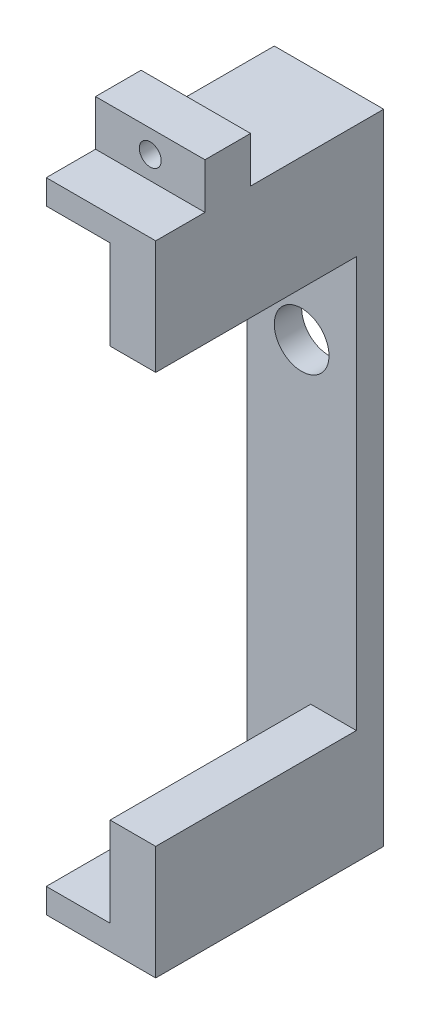
ISO-10303-21;
HEADER;
FILE_DESCRIPTION(('STEP AP214'),'2;1');
FILE_NAME('part.step','',(''),(''),'','','');
FILE_SCHEMA(('AUTOMOTIVE_DESIGN { 1 0 10303 214 1 1 1 1 }'));
ENDSEC;
DATA;
#1=APPLICATION_CONTEXT('core data for automotive mechanical design processes');
#2=APPLICATION_PROTOCOL_DEFINITION('international standard','automotive_design',2000,#1);
#3=PRODUCT_CONTEXT('',#1,'mechanical');
#4=PRODUCT('Part','Part','',(#3));
#5=PRODUCT_RELATED_PRODUCT_CATEGORY('part','',(#4));
#6=PRODUCT_DEFINITION_FORMATION('','',#4);
#7=PRODUCT_DEFINITION_CONTEXT('part definition',#1,'design');
#8=PRODUCT_DEFINITION('design','',#6,#7);
#9=PRODUCT_DEFINITION_SHAPE('','',#8);
#10=(LENGTH_UNIT() NAMED_UNIT(*) SI_UNIT(.MILLI.,.METRE.));
#11=(NAMED_UNIT(*) PLANE_ANGLE_UNIT() SI_UNIT($,.RADIAN.));
#12=(NAMED_UNIT(*) SI_UNIT($,.STERADIAN.) SOLID_ANGLE_UNIT());
#13=UNCERTAINTY_MEASURE_WITH_UNIT(LENGTH_MEASURE(1.E-05),#10,'distance_accuracy_value','');
#14=(GEOMETRIC_REPRESENTATION_CONTEXT(3) GLOBAL_UNCERTAINTY_ASSIGNED_CONTEXT((#13)) GLOBAL_UNIT_ASSIGNED_CONTEXT((#10,
#11,#12)) REPRESENTATION_CONTEXT('',''));
#15=CARTESIAN_POINT('',(0.,0.,0.));
#16=DIRECTION('',(0.,0.,1.));
#17=DIRECTION('',(1.,0.,0.));
#18=AXIS2_PLACEMENT_3D('',#15,#16,#17);
#19=CARTESIAN_POINT('',(-3.,17.5,12.5));
#20=DIRECTION('',(0.,-1.,0.));
#21=DIRECTION('',(0.,0.,-1.));
#22=AXIS2_PLACEMENT_3D('',#19,#20,#21);
#23=PLANE('',#22);
#24=DIRECTION('',(0.,0.,-1.));
#25=VECTOR('',#24,1.);
#26=CARTESIAN_POINT('',(-3.,17.5,12.5));
#27=LINE('',#26,#25);
#28=CARTESIAN_POINT('',(-3.,17.5,7.3));
#29=VERTEX_POINT('',#28);
#30=CARTESIAN_POINT('',(-3.,17.5,0.));
#31=VERTEX_POINT('',#30);
#32=EDGE_CURVE('E317',#29,#31,#27,.T.);
#33=ORIENTED_EDGE('',*,*,#32,.F.);
#34=DIRECTION('',(1.,0.,0.));
#35=VECTOR('',#34,1.);
#36=CARTESIAN_POINT('',(-3.,17.5,7.3));
#37=LINE('',#36,#35);
#38=CARTESIAN_POINT('',(3.,17.5,7.3));
#39=VERTEX_POINT('',#38);
#40=EDGE_CURVE('E168',#29,#39,#37,.T.);
#41=ORIENTED_EDGE('',*,*,#40,.T.);
#42=DIRECTION('',(0.,0.,-1.));
#43=VECTOR('',#42,1.);
#44=CARTESIAN_POINT('',(3.,17.5,12.5));
#45=LINE('',#44,#43);
#46=CARTESIAN_POINT('',(3.,17.5,0.));
#47=VERTEX_POINT('',#46);
#48=EDGE_CURVE('E321',#39,#47,#45,.T.);
#49=ORIENTED_EDGE('',*,*,#48,.T.);
#50=DIRECTION('',(-1.,0.,0.));
#51=VECTOR('',#50,1.);
#52=CARTESIAN_POINT('',(-3.,17.5,0.));
#53=LINE('',#52,#51);
#54=EDGE_CURVE('E300',#47,#31,#53,.T.);
#55=ORIENTED_EDGE('',*,*,#54,.T.);
#56=EDGE_LOOP('',(#33,#41,#49,#55));
#57=FACE_BOUND('',#56,.T.);
#58=ADVANCED_FACE('F47',(#57),#23,.F.);
#59=CARTESIAN_POINT('',(0.,0.,12.5));
#60=DIRECTION('',(0.,0.,-1.));
#61=DIRECTION('',(-1.,0.,0.));
#62=AXIS2_PLACEMENT_3D('',#59,#60,#61);
#63=PLANE('',#62);
#64=DIRECTION('',(0.,1.,0.));
#65=VECTOR('',#64,1.);
#66=CARTESIAN_POINT('',(0.499999999999997,0.,12.5));
#67=LINE('',#66,#65);
#68=CARTESIAN_POINT('',(0.499999999999997,11.25,12.5));
#69=VERTEX_POINT('',#68);
#70=CARTESIAN_POINT('',(0.499999999999997,16.15,12.5));
#71=VERTEX_POINT('',#70);
#72=EDGE_CURVE('E240',#69,#71,#67,.T.);
#73=ORIENTED_EDGE('',*,*,#72,.F.);
#74=DIRECTION('',(-1.,0.,0.));
#75=VECTOR('',#74,1.);
#76=CARTESIAN_POINT('',(3.,11.25,12.5));
#77=LINE('',#76,#75);
#78=CARTESIAN_POINT('',(3.,11.25,12.5));
#79=VERTEX_POINT('',#78);
#80=EDGE_CURVE('E251',#79,#69,#77,.T.);
#81=ORIENTED_EDGE('',*,*,#80,.F.);
#82=DIRECTION('',(0.,1.,0.));
#83=VECTOR('',#82,1.);
#84=CARTESIAN_POINT('',(3.,-17.5,12.5));
#85=LINE('',#84,#83);
#86=CARTESIAN_POINT('',(3.,17.5,12.5));
#87=VERTEX_POINT('',#86);
#88=EDGE_CURVE('E285',#79,#87,#85,.T.);
#89=ORIENTED_EDGE('',*,*,#88,.T.);
#90=DIRECTION('',(-1.,0.,0.));
#91=VECTOR('',#90,1.);
#92=CARTESIAN_POINT('',(-3.,17.5,12.5));
#93=LINE('',#92,#91);
#94=CARTESIAN_POINT('',(-3.,17.5,12.5));
#95=VERTEX_POINT('',#94);
#96=EDGE_CURVE('E284',#87,#95,#93,.T.);
#97=ORIENTED_EDGE('',*,*,#96,.T.);
#98=DIRECTION('',(0.,-1.,0.));
#99=VECTOR('',#98,1.);
#100=CARTESIAN_POINT('',(-3.,-17.5,12.5));
#101=LINE('',#100,#99);
#102=CARTESIAN_POINT('',(-3.,16.15,12.5));
#103=VERTEX_POINT('',#102);
#104=EDGE_CURVE('E289',#95,#103,#101,.T.);
#105=ORIENTED_EDGE('',*,*,#104,.T.);
#106=DIRECTION('',(-1.,0.,0.));
#107=VECTOR('',#106,1.);
#108=CARTESIAN_POINT('',(0.,16.15,12.5));
#109=LINE('',#108,#107);
#110=EDGE_CURVE('E243',#71,#103,#109,.T.);
#111=ORIENTED_EDGE('',*,*,#110,.F.);
#112=EDGE_LOOP('',(#73,#81,#89,#97,#105,#111));
#113=FACE_BOUND('',#112,.T.);
#114=ADVANCED_FACE('F342',(#113),#63,.F.);
#115=CARTESIAN_POINT('',(-3.,-17.5,12.5));
#116=DIRECTION('',(1.,0.,0.));
#117=DIRECTION('',(0.,0.,-1.));
#118=AXIS2_PLACEMENT_3D('',#115,#116,#117);
#119=PLANE('',#118);
#120=DIRECTION('',(0.,0.,-1.));
#121=VECTOR('',#120,1.);
#122=CARTESIAN_POINT('',(-3.,16.15,12.500012));
#123=LINE('',#122,#121);
#124=CARTESIAN_POINT('',(-3.,16.15,1.5));
#125=VERTEX_POINT('',#124);
#126=EDGE_CURVE('E219',#103,#125,#123,.T.);
#127=ORIENTED_EDGE('',*,*,#126,.F.);
#128=ORIENTED_EDGE('',*,*,#104,.F.);
#129=CARTESIAN_POINT('',(-3.,17.5,9.8));
#130=VERTEX_POINT('',#129);
#131=EDGE_CURVE('E318',#95,#130,#27,.T.);
#132=ORIENTED_EDGE('',*,*,#131,.T.);
#133=DIRECTION('',(0.,-1.,0.));
#134=VECTOR('',#133,1.);
#135=CARTESIAN_POINT('',(-3.,20.,9.8));
#136=LINE('',#135,#134);
#137=CARTESIAN_POINT('',(-3.,20.,9.8));
#138=VERTEX_POINT('',#137);
#139=EDGE_CURVE('E64',#138,#130,#136,.T.);
#140=ORIENTED_EDGE('',*,*,#139,.F.);
#141=DIRECTION('',(0.,0.,-1.));
#142=VECTOR('',#141,1.);
#143=CARTESIAN_POINT('',(-3.,20.,7.3));
#144=LINE('',#143,#142);
#145=CARTESIAN_POINT('',(-3.,20.,7.3));
#146=VERTEX_POINT('',#145);
#147=EDGE_CURVE('E181',#138,#146,#144,.T.);
#148=ORIENTED_EDGE('',*,*,#147,.T.);
#149=DIRECTION('',(0.,-1.,0.));
#150=VECTOR('',#149,1.);
#151=CARTESIAN_POINT('',(-3.,20.,7.3));
#152=LINE('',#151,#150);
#153=EDGE_CURVE('E163',#146,#29,#152,.T.);
#154=ORIENTED_EDGE('',*,*,#153,.T.);
#155=ORIENTED_EDGE('',*,*,#32,.T.);
#156=DIRECTION('',(0.,-1.,0.));
#157=VECTOR('',#156,1.);
#158=CARTESIAN_POINT('',(-3.,-17.5,0.));
#159=LINE('',#158,#157);
#160=CARTESIAN_POINT('',(-3.,-17.5,0.));
#161=VERTEX_POINT('',#160);
#162=EDGE_CURVE('E304',#31,#161,#159,.T.);
#163=ORIENTED_EDGE('',*,*,#162,.T.);
#164=DIRECTION('',(0.,0.,-1.));
#165=VECTOR('',#164,1.);
#166=CARTESIAN_POINT('',(-3.,-17.5,12.5));
#167=LINE('',#166,#165);
#168=CARTESIAN_POINT('',(-3.,-17.5,12.5));
#169=VERTEX_POINT('',#168);
#170=EDGE_CURVE('E313',#169,#161,#167,.T.);
#171=ORIENTED_EDGE('',*,*,#170,.F.);
#172=CARTESIAN_POINT('',(-3.,-16.15,12.5));
#173=VERTEX_POINT('',#172);
#174=EDGE_CURVE('E288',#173,#169,#101,.T.);
#175=ORIENTED_EDGE('',*,*,#174,.F.);
#176=DIRECTION('',(0.,0.,-1.));
#177=VECTOR('',#176,1.);
#178=CARTESIAN_POINT('',(-3.,-16.15,12.500012));
#179=LINE('',#178,#177);
#180=CARTESIAN_POINT('',(-3.,-16.15,1.5));
#181=VERTEX_POINT('',#180);
#182=EDGE_CURVE('E205',#173,#181,#179,.T.);
#183=ORIENTED_EDGE('',*,*,#182,.T.);
#184=DIRECTION('',(0.,-1.,0.));
#185=VECTOR('',#184,1.);
#186=CARTESIAN_POINT('',(-3.,11.25,1.5));
#187=LINE('',#186,#185);
#188=EDGE_CURVE('E262',#125,#181,#187,.T.);
#189=ORIENTED_EDGE('',*,*,#188,.F.);
#190=EDGE_LOOP('',(#127,#128,#132,#140,#148,#154,#155,#163,#171,#175,#183,#189));
#191=FACE_BOUND('',#190,.T.);
#192=ADVANCED_FACE('F187',(#191),#119,.F.);
#193=DIRECTION('',(0.,1.,0.));
#194=VECTOR('',#193,1.);
#195=CARTESIAN_POINT('',(0.499999999999997,0.,12.5));
#196=LINE('',#195,#194);
#197=CARTESIAN_POINT('',(0.5,-16.15,12.5));
#198=VERTEX_POINT('',#197);
#199=CARTESIAN_POINT('',(0.499999999999999,-11.25,12.5));
#200=VERTEX_POINT('',#199);
#201=EDGE_CURVE('E226',#198,#200,#196,.T.);
#202=ORIENTED_EDGE('',*,*,#201,.F.);
#203=DIRECTION('',(1.,0.,0.));
#204=VECTOR('',#203,1.);
#205=CARTESIAN_POINT('',(0.,-16.15,12.5));
#206=LINE('',#205,#204);
#207=EDGE_CURVE('E12',#173,#198,#206,.T.);
#208=ORIENTED_EDGE('',*,*,#207,.F.);
#209=ORIENTED_EDGE('',*,*,#174,.T.);
#210=DIRECTION('',(1.,0.,0.));
#211=VECTOR('',#210,1.);
#212=CARTESIAN_POINT('',(-3.,-17.5,12.5));
#213=LINE('',#212,#211);
#214=CARTESIAN_POINT('',(3.,-17.5,12.5));
#215=VERTEX_POINT('',#214);
#216=EDGE_CURVE('E293',#169,#215,#213,.T.);
#217=ORIENTED_EDGE('',*,*,#216,.T.);
#218=CARTESIAN_POINT('',(3.,-11.25,12.5));
#219=VERTEX_POINT('',#218);
#220=EDGE_CURVE('E280',#215,#219,#85,.T.);
#221=ORIENTED_EDGE('',*,*,#220,.T.);
#222=DIRECTION('',(1.,0.,0.));
#223=VECTOR('',#222,1.);
#224=CARTESIAN_POINT('',(-3.,-11.25,12.5));
#225=LINE('',#224,#223);
#226=EDGE_CURVE('E252',#200,#219,#225,.T.);
#227=ORIENTED_EDGE('',*,*,#226,.F.);
#228=EDGE_LOOP('',(#202,#208,#209,#217,#221,#227));
#229=FACE_BOUND('',#228,.T.);
#230=ADVANCED_FACE('F372',(#229),#63,.F.);
#231=CARTESIAN_POINT('',(3.,11.25,-23.28626204439));
#232=DIRECTION('',(0.,1.,0.));
#233=DIRECTION('',(0.,0.,1.));
#234=AXIS2_PLACEMENT_3D('',#231,#232,#233);
#235=PLANE('',#234);
#236=DIRECTION('',(0.,0.,1.));
#237=VECTOR('',#236,1.);
#238=CARTESIAN_POINT('',(0.499999999999997,11.25,-23.28626204439));
#239=LINE('',#238,#237);
#240=CARTESIAN_POINT('',(0.499999999999997,11.25,1.5));
#241=VERTEX_POINT('',#240);
#242=EDGE_CURVE('E57',#241,#69,#239,.T.);
#243=ORIENTED_EDGE('',*,*,#242,.F.);
#244=DIRECTION('',(-1.,0.,0.));
#245=VECTOR('',#244,1.);
#246=CARTESIAN_POINT('',(3.,11.25,1.5));
#247=LINE('',#246,#245);
#248=CARTESIAN_POINT('',(3.,11.25,1.5));
#249=VERTEX_POINT('',#248);
#250=EDGE_CURVE('E255',#249,#241,#247,.T.);
#251=ORIENTED_EDGE('',*,*,#250,.F.);
#252=DIRECTION('',(0.,0.,1.));
#253=VECTOR('',#252,1.);
#254=CARTESIAN_POINT('',(3.,11.25,-23.28626204439));
#255=LINE('',#254,#253);
#256=EDGE_CURVE('E267',#249,#79,#255,.T.);
#257=ORIENTED_EDGE('',*,*,#256,.T.);
#258=ORIENTED_EDGE('',*,*,#80,.T.);
#259=EDGE_LOOP('',(#243,#251,#257,#258));
#260=FACE_BOUND('',#259,.T.);
#261=ADVANCED_FACE('F344',(#260),#235,.F.);
#262=CARTESIAN_POINT('',(-3.,-11.25,-23.28626204439));
#263=DIRECTION('',(0.,-1.,0.));
#264=DIRECTION('',(0.,0.,-1.));
#265=AXIS2_PLACEMENT_3D('',#262,#263,#264);
#266=PLANE('',#265);
#267=DIRECTION('',(0.,0.,-1.));
#268=VECTOR('',#267,1.);
#269=CARTESIAN_POINT('',(0.499999999999999,-11.25,-23.28626204439));
#270=LINE('',#269,#268);
#271=CARTESIAN_POINT('',(0.5,-11.25,1.5));
#272=VERTEX_POINT('',#271);
#273=EDGE_CURVE('E326',#200,#272,#270,.T.);
#274=ORIENTED_EDGE('',*,*,#273,.F.);
#275=ORIENTED_EDGE('',*,*,#226,.T.);
#276=DIRECTION('',(0.,0.,1.));
#277=VECTOR('',#276,1.);
#278=CARTESIAN_POINT('',(3.,-11.25,-23.28626204439));
#279=LINE('',#278,#277);
#280=CARTESIAN_POINT('',(3.,-11.25,1.5));
#281=VERTEX_POINT('',#280);
#282=EDGE_CURVE('E268',#281,#219,#279,.T.);
#283=ORIENTED_EDGE('',*,*,#282,.F.);
#284=DIRECTION('',(1.,0.,0.));
#285=VECTOR('',#284,1.);
#286=CARTESIAN_POINT('',(-3.,-11.25,1.5));
#287=LINE('',#286,#285);
#288=EDGE_CURVE('E269',#272,#281,#287,.T.);
#289=ORIENTED_EDGE('',*,*,#288,.F.);
#290=EDGE_LOOP('',(#274,#275,#283,#289));
#291=FACE_BOUND('',#290,.T.);
#292=ADVANCED_FACE('F389',(#291),#266,.F.);
#293=CARTESIAN_POINT('',(3.,-17.5,12.5));
#294=DIRECTION('',(-1.,0.,0.));
#295=DIRECTION('',(0.,0.,1.));
#296=AXIS2_PLACEMENT_3D('',#293,#294,#295);
#297=PLANE('',#296);
#298=ORIENTED_EDGE('',*,*,#88,.F.);
#299=ORIENTED_EDGE('',*,*,#256,.F.);
#300=DIRECTION('',(0.,1.,0.));
#301=VECTOR('',#300,1.);
#302=CARTESIAN_POINT('',(3.,-11.25,1.5));
#303=LINE('',#302,#301);
#304=EDGE_CURVE('E263',#281,#249,#303,.T.);
#305=ORIENTED_EDGE('',*,*,#304,.F.);
#306=ORIENTED_EDGE('',*,*,#282,.T.);
#307=ORIENTED_EDGE('',*,*,#220,.F.);
#308=DIRECTION('',(0.,0.,-1.));
#309=VECTOR('',#308,1.);
#310=CARTESIAN_POINT('',(3.,-17.5,12.5));
#311=LINE('',#310,#309);
#312=CARTESIAN_POINT('',(3.,-17.5,0.));
#313=VERTEX_POINT('',#312);
#314=EDGE_CURVE('E296',#215,#313,#311,.T.);
#315=ORIENTED_EDGE('',*,*,#314,.T.);
#316=DIRECTION('',(0.,1.,0.));
#317=VECTOR('',#316,1.);
#318=CARTESIAN_POINT('',(3.,-17.5,0.));
#319=LINE('',#318,#317);
#320=EDGE_CURVE('E279',#313,#47,#319,.T.);
#321=ORIENTED_EDGE('',*,*,#320,.T.);
#322=ORIENTED_EDGE('',*,*,#48,.F.);
#323=DIRECTION('',(0.,-1.,0.));
#324=VECTOR('',#323,1.);
#325=CARTESIAN_POINT('',(3.,20.,7.3));
#326=LINE('',#325,#324);
#327=CARTESIAN_POINT('',(3.,20.,7.3));
#328=VERTEX_POINT('',#327);
#329=EDGE_CURVE('E173',#328,#39,#326,.T.);
#330=ORIENTED_EDGE('',*,*,#329,.F.);
#331=DIRECTION('',(0.,0.,1.));
#332=VECTOR('',#331,1.);
#333=CARTESIAN_POINT('',(3.,20.,7.3));
#334=LINE('',#333,#332);
#335=CARTESIAN_POINT('',(3.,20.,9.8));
#336=VERTEX_POINT('',#335);
#337=EDGE_CURVE('E183',#328,#336,#334,.T.);
#338=ORIENTED_EDGE('',*,*,#337,.T.);
#339=DIRECTION('',(0.,-1.,0.));
#340=VECTOR('',#339,1.);
#341=CARTESIAN_POINT('',(3.,20.,9.8));
#342=LINE('',#341,#340);
#343=CARTESIAN_POINT('',(3.,17.5,9.8));
#344=VERTEX_POINT('',#343);
#345=EDGE_CURVE('E206',#336,#344,#342,.T.);
#346=ORIENTED_EDGE('',*,*,#345,.T.);
#347=EDGE_CURVE('E322',#87,#344,#45,.T.);
#348=ORIENTED_EDGE('',*,*,#347,.F.);
#349=EDGE_LOOP('',(#298,#299,#305,#306,#307,#315,#321,#322,#330,#338,#346,#348));
#350=FACE_BOUND('',#349,.T.);
#351=ADVANCED_FACE('F49',(#350),#297,.F.);
#352=ORIENTED_EDGE('',*,*,#347,.T.);
#353=DIRECTION('',(-1.,0.,0.));
#354=VECTOR('',#353,1.);
#355=CARTESIAN_POINT('',(-3.,17.5,9.8));
#356=LINE('',#355,#354);
#357=EDGE_CURVE('E190',#344,#130,#356,.T.);
#358=ORIENTED_EDGE('',*,*,#357,.T.);
#359=ORIENTED_EDGE('',*,*,#131,.F.);
#360=ORIENTED_EDGE('',*,*,#96,.F.);
#361=EDGE_LOOP('',(#352,#358,#359,#360));
#362=FACE_BOUND('',#361,.T.);
#363=ADVANCED_FACE('F397',(#362),#23,.F.);
#364=CARTESIAN_POINT('',(-3.,-17.5,12.5));
#365=DIRECTION('',(0.,1.,0.));
#366=DIRECTION('',(0.,0.,1.));
#367=AXIS2_PLACEMENT_3D('',#364,#365,#366);
#368=PLANE('',#367);
#369=DIRECTION('',(1.,0.,0.));
#370=VECTOR('',#369,1.);
#371=CARTESIAN_POINT('',(-3.,-17.5,0.));
#372=LINE('',#371,#370);
#373=EDGE_CURVE('E307',#161,#313,#372,.T.);
#374=ORIENTED_EDGE('',*,*,#373,.T.);
#375=ORIENTED_EDGE('',*,*,#314,.F.);
#376=ORIENTED_EDGE('',*,*,#216,.F.);
#377=ORIENTED_EDGE('',*,*,#170,.T.);
#378=EDGE_LOOP('',(#374,#375,#376,#377));
#379=FACE_BOUND('',#378,.T.);
#380=ADVANCED_FACE('F366',(#379),#368,.F.);
#381=CARTESIAN_POINT('',(0.,0.,0.));
#382=DIRECTION('',(0.,0.,-1.));
#383=DIRECTION('',(-1.,0.,0.));
#384=AXIS2_PLACEMENT_3D('',#381,#382,#383);
#385=PLANE('',#384);
#386=CARTESIAN_POINT('',(0.,5.8,0.));
#387=DIRECTION('',(0.,0.,-1.));
#388=DIRECTION('',(-1.,0.,0.));
#389=AXIS2_PLACEMENT_3D('',#386,#387,#388);
#390=CIRCLE('',#389,1.5);
#391=CARTESIAN_POINT('',(-1.5,5.8,0.));
#392=VERTEX_POINT('',#391);
#393=EDGE_CURVE('E247',#392,#392,#390,.T.);
#394=ORIENTED_EDGE('',*,*,#393,.F.);
#395=EDGE_LOOP('',(#394));
#396=FACE_BOUND('',#395,.T.);
#397=ORIENTED_EDGE('',*,*,#320,.F.);
#398=ORIENTED_EDGE('',*,*,#373,.F.);
#399=ORIENTED_EDGE('',*,*,#162,.F.);
#400=ORIENTED_EDGE('',*,*,#54,.F.);
#401=EDGE_LOOP('',(#397,#398,#399,#400));
#402=FACE_BOUND('',#401,.T.);
#403=ADVANCED_FACE('F360',(#396,#402),#385,.T.);
#404=CARTESIAN_POINT('',(0.,0.,1.5));
#405=DIRECTION('',(0.,0.,-1.));
#406=DIRECTION('',(-1.,0.,0.));
#407=AXIS2_PLACEMENT_3D('',#404,#405,#406);
#408=PLANE('',#407);
#409=CARTESIAN_POINT('',(0.,5.8,1.5));
#410=DIRECTION('',(0.,0.,-1.));
#411=DIRECTION('',(-1.,0.,0.));
#412=AXIS2_PLACEMENT_3D('',#409,#410,#411);
#413=CIRCLE('',#412,1.5);
#414=CARTESIAN_POINT('',(-1.5,5.8,1.5));
#415=VERTEX_POINT('',#414);
#416=EDGE_CURVE('E246',#415,#415,#413,.T.);
#417=ORIENTED_EDGE('',*,*,#416,.T.);
#418=EDGE_LOOP('',(#417));
#419=FACE_BOUND('',#418,.T.);
#420=ORIENTED_EDGE('',*,*,#304,.T.);
#421=ORIENTED_EDGE('',*,*,#250,.T.);
#422=DIRECTION('',(0.,1.,0.));
#423=VECTOR('',#422,1.);
#424=CARTESIAN_POINT('',(0.499999999999997,11.25,1.5));
#425=LINE('',#424,#423);
#426=CARTESIAN_POINT('',(0.499999999999997,16.15,1.5));
#427=VERTEX_POINT('',#426);
#428=EDGE_CURVE('E211',#241,#427,#425,.T.);
#429=ORIENTED_EDGE('',*,*,#428,.T.);
#430=DIRECTION('',(-1.,0.,0.));
#431=VECTOR('',#430,1.);
#432=CARTESIAN_POINT('',(0.499999999999997,16.15,1.5));
#433=LINE('',#432,#431);
#434=EDGE_CURVE('E215',#427,#125,#433,.T.);
#435=ORIENTED_EDGE('',*,*,#434,.T.);
#436=ORIENTED_EDGE('',*,*,#188,.T.);
#437=DIRECTION('',(1.,0.,0.));
#438=VECTOR('',#437,1.);
#439=CARTESIAN_POINT('',(0.5,-16.15,1.5));
#440=LINE('',#439,#438);
#441=CARTESIAN_POINT('',(0.5,-16.15,1.5));
#442=VERTEX_POINT('',#441);
#443=EDGE_CURVE('E233',#181,#442,#440,.T.);
#444=ORIENTED_EDGE('',*,*,#443,.T.);
#445=DIRECTION('',(0.,1.,0.));
#446=VECTOR('',#445,1.);
#447=CARTESIAN_POINT('',(0.499999999999999,-11.25,1.5));
#448=LINE('',#447,#446);
#449=EDGE_CURVE('E72',#442,#272,#448,.T.);
#450=ORIENTED_EDGE('',*,*,#449,.T.);
#451=ORIENTED_EDGE('',*,*,#288,.T.);
#452=EDGE_LOOP('',(#420,#421,#429,#435,#436,#444,#450,#451));
#453=FACE_BOUND('',#452,.T.);
#454=ADVANCED_FACE('F382',(#419,#453),#408,.F.);
#455=CARTESIAN_POINT('',(0.,5.8,12.5));
#456=DIRECTION('',(0.,0.,-1.));
#457=DIRECTION('',(-1.,0.,0.));
#458=AXIS2_PLACEMENT_3D('',#455,#456,#457);
#459=CYLINDRICAL_SURFACE('',#458,1.5);
#460=ORIENTED_EDGE('',*,*,#393,.T.);
#461=EDGE_LOOP('',(#460));
#462=FACE_BOUND('',#461,.T.);
#463=ORIENTED_EDGE('',*,*,#416,.F.);
#464=EDGE_LOOP('',(#463));
#465=FACE_BOUND('',#464,.T.);
#466=ADVANCED_FACE('F435',(#462,#465),#459,.F.);
#467=CARTESIAN_POINT('',(0.5,-16.15,12.500012));
#468=DIRECTION('',(0.,1.,0.));
#469=DIRECTION('',(0.,0.,1.));
#470=AXIS2_PLACEMENT_3D('',#467,#468,#469);
#471=PLANE('',#470);
#472=ORIENTED_EDGE('',*,*,#207,.T.);
#473=DIRECTION('',(0.,0.,-1.));
#474=VECTOR('',#473,1.);
#475=CARTESIAN_POINT('',(0.5,-16.15,12.500012));
#476=LINE('',#475,#474);
#477=EDGE_CURVE('E230',#198,#442,#476,.T.);
#478=ORIENTED_EDGE('',*,*,#477,.T.);
#479=ORIENTED_EDGE('',*,*,#443,.F.);
#480=ORIENTED_EDGE('',*,*,#182,.F.);
#481=EDGE_LOOP('',(#472,#478,#479,#480));
#482=FACE_BOUND('',#481,.T.);
#483=ADVANCED_FACE('F376',(#482),#471,.T.);
#484=CARTESIAN_POINT('',(0.499999999999999,-11.25,12.500012));
#485=DIRECTION('',(-1.,0.,0.));
#486=DIRECTION('',(0.,-1.,0.));
#487=AXIS2_PLACEMENT_3D('',#484,#485,#486);
#488=PLANE('',#487);
#489=ORIENTED_EDGE('',*,*,#201,.T.);
#490=ORIENTED_EDGE('',*,*,#273,.T.);
#491=ORIENTED_EDGE('',*,*,#449,.F.);
#492=ORIENTED_EDGE('',*,*,#477,.F.);
#493=EDGE_LOOP('',(#489,#490,#491,#492));
#494=FACE_BOUND('',#493,.T.);
#495=ADVANCED_FACE('F379',(#494),#488,.T.);
#496=CARTESIAN_POINT('',(0.499999999999997,16.15,12.500012));
#497=DIRECTION('',(0.,-1.,0.));
#498=DIRECTION('',(0.,0.,-1.));
#499=AXIS2_PLACEMENT_3D('',#496,#497,#498);
#500=PLANE('',#499);
#501=ORIENTED_EDGE('',*,*,#110,.T.);
#502=ORIENTED_EDGE('',*,*,#126,.T.);
#503=ORIENTED_EDGE('',*,*,#434,.F.);
#504=DIRECTION('',(0.,0.,-1.));
#505=VECTOR('',#504,1.);
#506=CARTESIAN_POINT('',(0.499999999999997,16.15,12.500012));
#507=LINE('',#506,#505);
#508=EDGE_CURVE('E223',#71,#427,#507,.T.);
#509=ORIENTED_EDGE('',*,*,#508,.F.);
#510=EDGE_LOOP('',(#501,#502,#503,#509));
#511=FACE_BOUND('',#510,.T.);
#512=ADVANCED_FACE('F386',(#511),#500,.T.);
#513=CARTESIAN_POINT('',(0.499999999999997,11.25,12.500012));
#514=DIRECTION('',(-1.,0.,0.));
#515=DIRECTION('',(0.,0.,1.));
#516=AXIS2_PLACEMENT_3D('',#513,#514,#515);
#517=PLANE('',#516);
#518=ORIENTED_EDGE('',*,*,#72,.T.);
#519=ORIENTED_EDGE('',*,*,#508,.T.);
#520=ORIENTED_EDGE('',*,*,#428,.F.);
#521=ORIENTED_EDGE('',*,*,#242,.T.);
#522=EDGE_LOOP('',(#518,#519,#520,#521));
#523=FACE_BOUND('',#522,.T.);
#524=ADVANCED_FACE('F336',(#523),#517,.T.);
#525=CARTESIAN_POINT('',(-3.,20.,9.8));
#526=DIRECTION('',(0.,0.,1.));
#527=DIRECTION('',(1.,0.,0.));
#528=AXIS2_PLACEMENT_3D('',#525,#526,#527);
#529=PLANE('',#528);
#530=CARTESIAN_POINT('',(0.,18.75,9.8));
#531=DIRECTION('',(0.,0.,1.));
#532=DIRECTION('',(1.,0.,0.));
#533=AXIS2_PLACEMENT_3D('',#530,#531,#532);
#534=CIRCLE('',#533,0.6);
#535=CARTESIAN_POINT('',(0.6,18.75,9.8));
#536=VERTEX_POINT('',#535);
#537=EDGE_CURVE('E195',#536,#536,#534,.T.);
#538=ORIENTED_EDGE('',*,*,#537,.F.);
#539=EDGE_LOOP('',(#538));
#540=FACE_BOUND('',#539,.T.);
#541=ORIENTED_EDGE('',*,*,#357,.F.);
#542=ORIENTED_EDGE('',*,*,#345,.F.);
#543=DIRECTION('',(-1.,0.,0.));
#544=VECTOR('',#543,1.);
#545=CARTESIAN_POINT('',(-3.,20.,9.8));
#546=LINE('',#545,#544);
#547=EDGE_CURVE('E174',#336,#138,#546,.T.);
#548=ORIENTED_EDGE('',*,*,#547,.T.);
#549=ORIENTED_EDGE('',*,*,#139,.T.);
#550=EDGE_LOOP('',(#541,#542,#548,#549));
#551=FACE_BOUND('',#550,.T.);
#552=ADVANCED_FACE('F416',(#540,#551),#529,.T.);
#553=CARTESIAN_POINT('',(-3.,20.,7.3));
#554=DIRECTION('',(0.,0.,-1.));
#555=DIRECTION('',(-1.,0.,0.));
#556=AXIS2_PLACEMENT_3D('',#553,#554,#555);
#557=PLANE('',#556);
#558=CARTESIAN_POINT('',(0.,18.75,7.3));
#559=DIRECTION('',(0.,0.,-1.));
#560=DIRECTION('',(-1.,0.,0.));
#561=AXIS2_PLACEMENT_3D('',#558,#559,#560);
#562=CIRCLE('',#561,0.6);
#563=CARTESIAN_POINT('',(-0.6,18.75,7.3));
#564=VERTEX_POINT('',#563);
#565=EDGE_CURVE('E51',#564,#564,#562,.T.);
#566=ORIENTED_EDGE('',*,*,#565,.F.);
#567=EDGE_LOOP('',(#566));
#568=FACE_BOUND('',#567,.T.);
#569=ORIENTED_EDGE('',*,*,#40,.F.);
#570=ORIENTED_EDGE('',*,*,#153,.F.);
#571=DIRECTION('',(1.,0.,0.));
#572=VECTOR('',#571,1.);
#573=CARTESIAN_POINT('',(-3.,20.,7.3));
#574=LINE('',#573,#572);
#575=EDGE_CURVE('E166',#146,#328,#574,.T.);
#576=ORIENTED_EDGE('',*,*,#575,.T.);
#577=ORIENTED_EDGE('',*,*,#329,.T.);
#578=EDGE_LOOP('',(#569,#570,#576,#577));
#579=FACE_BOUND('',#578,.T.);
#580=ADVANCED_FACE('F165',(#568,#579),#557,.T.);
#581=CARTESIAN_POINT('',(0.,20.,0.));
#582=DIRECTION('',(0.,1.,0.));
#583=DIRECTION('',(0.,0.,1.));
#584=AXIS2_PLACEMENT_3D('',#581,#582,#583);
#585=PLANE('',#584);
#586=ORIENTED_EDGE('',*,*,#147,.F.);
#587=ORIENTED_EDGE('',*,*,#547,.F.);
#588=ORIENTED_EDGE('',*,*,#337,.F.);
#589=ORIENTED_EDGE('',*,*,#575,.F.);
#590=EDGE_LOOP('',(#586,#587,#588,#589));
#591=FACE_BOUND('',#590,.T.);
#592=ADVANCED_FACE('F179',(#591),#585,.T.);
#593=CARTESIAN_POINT('',(0.,18.75,0.));
#594=DIRECTION('',(0.,0.,1.));
#595=DIRECTION('',(1.,0.,0.));
#596=AXIS2_PLACEMENT_3D('',#593,#594,#595);
#597=CYLINDRICAL_SURFACE('',#596,0.6);
#598=ORIENTED_EDGE('',*,*,#537,.T.);
#599=EDGE_LOOP('',(#598));
#600=FACE_BOUND('',#599,.T.);
#601=ORIENTED_EDGE('',*,*,#565,.T.);
#602=EDGE_LOOP('',(#601));
#603=FACE_BOUND('',#602,.T.);
#604=ADVANCED_FACE('F522',(#600,#603),#597,.F.);
#605=CLOSED_SHELL('',(#58,#114,#192,#230,#261,#292,#351,#363,#380,#403,#454,#466,#483,#495,#512,
#524,#552,#580,#592,#604));
#606=MANIFOLD_SOLID_BREP('B2',#605);
#607=ADVANCED_BREP_SHAPE_REPRESENTATION('',(#18,#606),#14);
#608=SHAPE_DEFINITION_REPRESENTATION(#9,#607);
ENDSEC;
END-ISO-10303-21;
